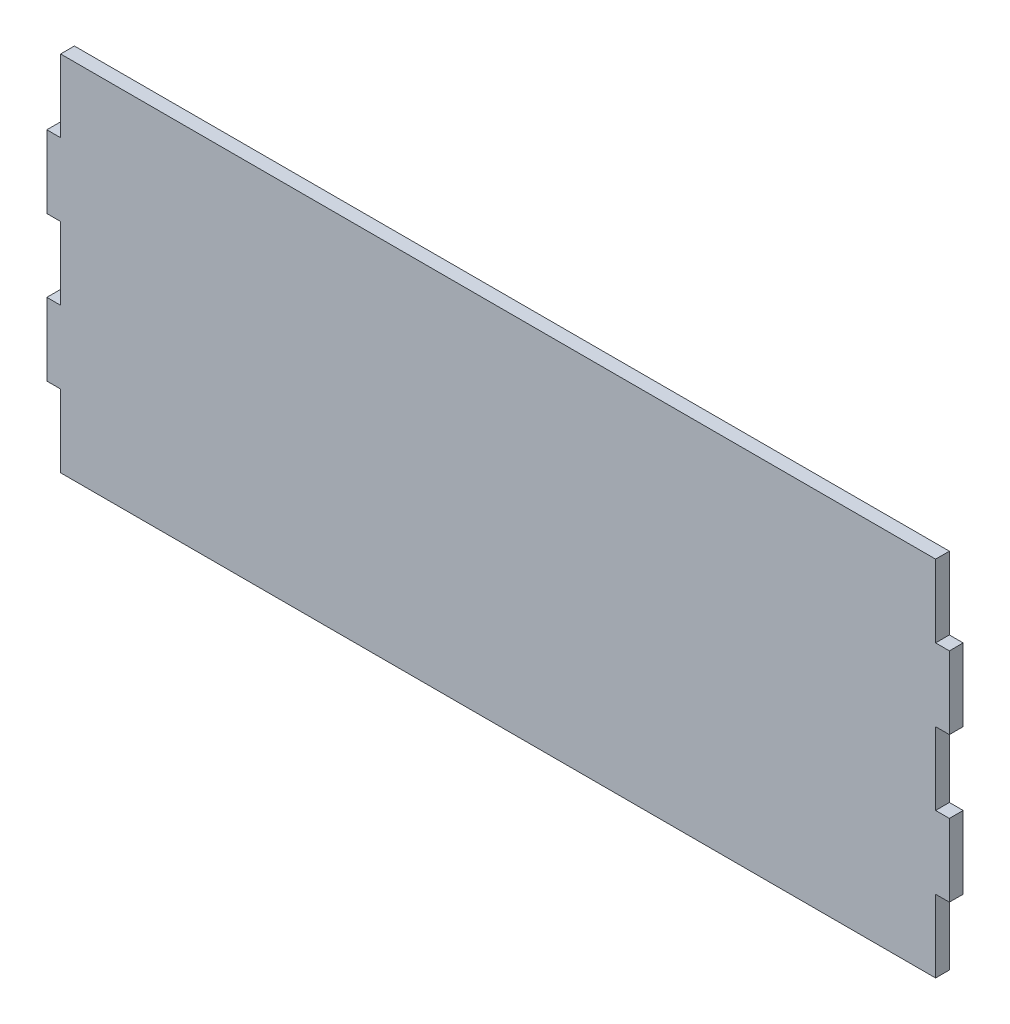
ISO-10303-21;
HEADER;
FILE_DESCRIPTION(('STEP AP214'),'2;1');
FILE_NAME('part.step','',(''),(''),'','','');
FILE_SCHEMA(('AUTOMOTIVE_DESIGN { 1 0 10303 214 1 1 1 1 }'));
ENDSEC;
DATA;
#1=APPLICATION_CONTEXT('core data for automotive mechanical design processes');
#2=APPLICATION_PROTOCOL_DEFINITION('international standard','automotive_design',2000,#1);
#3=PRODUCT_CONTEXT('',#1,'mechanical');
#4=PRODUCT('Part','Part','',(#3));
#5=PRODUCT_RELATED_PRODUCT_CATEGORY('part','',(#4));
#6=PRODUCT_DEFINITION_FORMATION('','',#4);
#7=PRODUCT_DEFINITION_CONTEXT('part definition',#1,'design');
#8=PRODUCT_DEFINITION('design','',#6,#7);
#9=PRODUCT_DEFINITION_SHAPE('','',#8);
#10=(LENGTH_UNIT() NAMED_UNIT(*) SI_UNIT(.MILLI.,.METRE.));
#11=(NAMED_UNIT(*) PLANE_ANGLE_UNIT() SI_UNIT($,.RADIAN.));
#12=(NAMED_UNIT(*) SI_UNIT($,.STERADIAN.) SOLID_ANGLE_UNIT());
#13=UNCERTAINTY_MEASURE_WITH_UNIT(LENGTH_MEASURE(1.E-05),#10,'distance_accuracy_value','');
#14=(GEOMETRIC_REPRESENTATION_CONTEXT(3) GLOBAL_UNCERTAINTY_ASSIGNED_CONTEXT((#13)) GLOBAL_UNIT_ASSIGNED_CONTEXT((#10,
#11,#12)) REPRESENTATION_CONTEXT('',''));
#15=CARTESIAN_POINT('',(0.,0.,0.));
#16=DIRECTION('',(0.,0.,1.));
#17=DIRECTION('',(1.,0.,0.));
#18=AXIS2_PLACEMENT_3D('',#15,#16,#17);
#19=CARTESIAN_POINT('',(4.82599999999997,127.,4.826));
#20=DIRECTION('',(1.,0.,0.));
#21=DIRECTION('',(0.,1.,0.));
#22=AXIS2_PLACEMENT_3D('',#19,#20,#21);
#23=PLANE('',#22);
#24=DIRECTION('',(0.,-1.,0.));
#25=VECTOR('',#24,1.);
#26=CARTESIAN_POINT('',(4.82599999999997,127.,0.));
#27=LINE('',#26,#25);
#28=CARTESIAN_POINT('',(4.82599999999997,127.,0.));
#29=VERTEX_POINT('',#28);
#30=CARTESIAN_POINT('',(4.82599999999999,101.6,0.));
#31=VERTEX_POINT('',#30);
#32=EDGE_CURVE('E203',#29,#31,#27,.T.);
#33=ORIENTED_EDGE('',*,*,#32,.T.);
#34=DIRECTION('',(0.,0.,-1.));
#35=VECTOR('',#34,1.);
#36=CARTESIAN_POINT('',(4.82599999999999,101.6,4.826));
#37=LINE('',#36,#35);
#38=CARTESIAN_POINT('',(4.82599999999999,101.6,4.826));
#39=VERTEX_POINT('',#38);
#40=EDGE_CURVE('E11',#39,#31,#37,.T.);
#41=ORIENTED_EDGE('',*,*,#40,.F.);
#42=DIRECTION('',(0.,-1.,0.));
#43=VECTOR('',#42,1.);
#44=CARTESIAN_POINT('',(4.82599999999997,127.,4.826));
#45=LINE('',#44,#43);
#46=CARTESIAN_POINT('',(4.82599999999997,127.,4.826));
#47=VERTEX_POINT('',#46);
#48=EDGE_CURVE('E125',#47,#39,#45,.T.);
#49=ORIENTED_EDGE('',*,*,#48,.F.);
#50=DIRECTION('',(0.,0.,-1.));
#51=VECTOR('',#50,1.);
#52=CARTESIAN_POINT('',(4.82599999999997,127.,4.826));
#53=LINE('',#52,#51);
#54=EDGE_CURVE('E51',#47,#29,#53,.T.);
#55=ORIENTED_EDGE('',*,*,#54,.T.);
#56=EDGE_LOOP('',(#33,#41,#49,#55));
#57=FACE_BOUND('',#56,.T.);
#58=ADVANCED_FACE('F35',(#57),#23,.F.);
#59=CARTESIAN_POINT('',(0.,101.6,4.826));
#60=DIRECTION('',(0.,1.,0.));
#61=DIRECTION('',(-1.,0.,0.));
#62=AXIS2_PLACEMENT_3D('',#59,#60,#61);
#63=PLANE('',#62);
#64=DIRECTION('',(1.,0.,0.));
#65=VECTOR('',#64,1.);
#66=CARTESIAN_POINT('',(0.,101.6,0.));
#67=LINE('',#66,#65);
#68=CARTESIAN_POINT('',(0.,101.6,0.));
#69=VERTEX_POINT('',#68);
#70=EDGE_CURVE('E205',#69,#31,#67,.T.);
#71=ORIENTED_EDGE('',*,*,#70,.F.);
#72=DIRECTION('',(0.,0.,-1.));
#73=VECTOR('',#72,1.);
#74=CARTESIAN_POINT('',(0.,101.6,4.826));
#75=LINE('',#74,#73);
#76=CARTESIAN_POINT('',(0.,101.6,4.826));
#77=VERTEX_POINT('',#76);
#78=EDGE_CURVE('E43',#77,#69,#75,.T.);
#79=ORIENTED_EDGE('',*,*,#78,.F.);
#80=DIRECTION('',(1.,0.,0.));
#81=VECTOR('',#80,1.);
#82=CARTESIAN_POINT('',(0.,101.6,4.826));
#83=LINE('',#82,#81);
#84=EDGE_CURVE('E366',#77,#39,#83,.T.);
#85=ORIENTED_EDGE('',*,*,#84,.T.);
#86=ORIENTED_EDGE('',*,*,#40,.T.);
#87=EDGE_LOOP('',(#71,#79,#85,#86));
#88=FACE_BOUND('',#87,.T.);
#89=ADVANCED_FACE('F298',(#88),#63,.T.);
#90=CARTESIAN_POINT('',(0.,76.2,4.826));
#91=DIRECTION('',(-1.,0.,0.));
#92=DIRECTION('',(0.,-1.,0.));
#93=AXIS2_PLACEMENT_3D('',#90,#91,#92);
#94=PLANE('',#93);
#95=DIRECTION('',(0.,1.,0.));
#96=VECTOR('',#95,1.);
#97=CARTESIAN_POINT('',(0.,76.2,0.));
#98=LINE('',#97,#96);
#99=CARTESIAN_POINT('',(0.,76.2,0.));
#100=VERTEX_POINT('',#99);
#101=EDGE_CURVE('E208',#100,#69,#98,.T.);
#102=ORIENTED_EDGE('',*,*,#101,.F.);
#103=DIRECTION('',(0.,0.,-1.));
#104=VECTOR('',#103,1.);
#105=CARTESIAN_POINT('',(0.,76.2,4.826));
#106=LINE('',#105,#104);
#107=CARTESIAN_POINT('',(0.,76.2,4.826));
#108=VERTEX_POINT('',#107);
#109=EDGE_CURVE('E288',#108,#100,#106,.T.);
#110=ORIENTED_EDGE('',*,*,#109,.F.);
#111=DIRECTION('',(0.,1.,0.));
#112=VECTOR('',#111,1.);
#113=CARTESIAN_POINT('',(0.,76.2,4.826));
#114=LINE('',#113,#112);
#115=EDGE_CURVE('E295',#108,#77,#114,.T.);
#116=ORIENTED_EDGE('',*,*,#115,.T.);
#117=ORIENTED_EDGE('',*,*,#78,.T.);
#118=EDGE_LOOP('',(#102,#110,#116,#117));
#119=FACE_BOUND('',#118,.T.);
#120=ADVANCED_FACE('F293',(#119),#94,.T.);
#121=CARTESIAN_POINT('',(0.,76.2,4.826));
#122=DIRECTION('',(0.,1.,0.));
#123=DIRECTION('',(-1.,0.,0.));
#124=AXIS2_PLACEMENT_3D('',#121,#122,#123);
#125=PLANE('',#124);
#126=DIRECTION('',(1.,0.,0.));
#127=VECTOR('',#126,1.);
#128=CARTESIAN_POINT('',(0.,76.2,0.));
#129=LINE('',#128,#127);
#130=CARTESIAN_POINT('',(4.82599999999998,76.2,0.));
#131=VERTEX_POINT('',#130);
#132=EDGE_CURVE('E211',#100,#131,#129,.T.);
#133=ORIENTED_EDGE('',*,*,#132,.T.);
#134=DIRECTION('',(0.,0.,-1.));
#135=VECTOR('',#134,1.);
#136=CARTESIAN_POINT('',(4.82599999999998,76.2,4.826));
#137=LINE('',#136,#135);
#138=CARTESIAN_POINT('',(4.82599999999998,76.2,4.826));
#139=VERTEX_POINT('',#138);
#140=EDGE_CURVE('E285',#139,#131,#137,.T.);
#141=ORIENTED_EDGE('',*,*,#140,.F.);
#142=DIRECTION('',(1.,0.,0.));
#143=VECTOR('',#142,1.);
#144=CARTESIAN_POINT('',(0.,76.2,4.826));
#145=LINE('',#144,#143);
#146=EDGE_CURVE('E315',#108,#139,#145,.T.);
#147=ORIENTED_EDGE('',*,*,#146,.F.);
#148=ORIENTED_EDGE('',*,*,#109,.T.);
#149=EDGE_LOOP('',(#133,#141,#147,#148));
#150=FACE_BOUND('',#149,.T.);
#151=ADVANCED_FACE('F305',(#150),#125,.F.);
#152=CARTESIAN_POINT('',(4.82599999999998,76.2,4.826));
#153=DIRECTION('',(1.,0.,0.));
#154=DIRECTION('',(0.,1.,0.));
#155=AXIS2_PLACEMENT_3D('',#152,#153,#154);
#156=PLANE('',#155);
#157=DIRECTION('',(0.,-1.,0.));
#158=VECTOR('',#157,1.);
#159=CARTESIAN_POINT('',(4.82599999999998,76.2,0.));
#160=LINE('',#159,#158);
#161=CARTESIAN_POINT('',(4.82599999999995,50.8,0.));
#162=VERTEX_POINT('',#161);
#163=EDGE_CURVE('E213',#131,#162,#160,.T.);
#164=ORIENTED_EDGE('',*,*,#163,.T.);
#165=DIRECTION('',(0.,0.,-1.));
#166=VECTOR('',#165,1.);
#167=CARTESIAN_POINT('',(4.82599999999995,50.8,4.826));
#168=LINE('',#167,#166);
#169=CARTESIAN_POINT('',(4.82599999999995,50.8,4.826));
#170=VERTEX_POINT('',#169);
#171=EDGE_CURVE('E283',#170,#162,#168,.T.);
#172=ORIENTED_EDGE('',*,*,#171,.F.);
#173=DIRECTION('',(0.,-1.,0.));
#174=VECTOR('',#173,1.);
#175=CARTESIAN_POINT('',(4.82599999999998,76.2,4.826));
#176=LINE('',#175,#174);
#177=EDGE_CURVE('E311',#139,#170,#176,.T.);
#178=ORIENTED_EDGE('',*,*,#177,.F.);
#179=ORIENTED_EDGE('',*,*,#140,.T.);
#180=EDGE_LOOP('',(#164,#172,#178,#179));
#181=FACE_BOUND('',#180,.T.);
#182=ADVANCED_FACE('F309',(#181),#156,.F.);
#183=CARTESIAN_POINT('',(0.,50.8,4.826));
#184=DIRECTION('',(0.,1.,0.));
#185=DIRECTION('',(-1.,0.,0.));
#186=AXIS2_PLACEMENT_3D('',#183,#184,#185);
#187=PLANE('',#186);
#188=DIRECTION('',(1.,0.,0.));
#189=VECTOR('',#188,1.);
#190=CARTESIAN_POINT('',(0.,50.8,0.));
#191=LINE('',#190,#189);
#192=CARTESIAN_POINT('',(0.,50.8,0.));
#193=VERTEX_POINT('',#192);
#194=EDGE_CURVE('E216',#193,#162,#191,.T.);
#195=ORIENTED_EDGE('',*,*,#194,.F.);
#196=DIRECTION('',(0.,0.,-1.));
#197=VECTOR('',#196,1.);
#198=CARTESIAN_POINT('',(0.,50.8,4.826));
#199=LINE('',#198,#197);
#200=CARTESIAN_POINT('',(0.,50.8,4.826));
#201=VERTEX_POINT('',#200);
#202=EDGE_CURVE('E281',#201,#193,#199,.T.);
#203=ORIENTED_EDGE('',*,*,#202,.F.);
#204=DIRECTION('',(1.,0.,0.));
#205=VECTOR('',#204,1.);
#206=CARTESIAN_POINT('',(0.,50.8,4.826));
#207=LINE('',#206,#205);
#208=EDGE_CURVE('E314',#201,#170,#207,.T.);
#209=ORIENTED_EDGE('',*,*,#208,.T.);
#210=ORIENTED_EDGE('',*,*,#171,.T.);
#211=EDGE_LOOP('',(#195,#203,#209,#210));
#212=FACE_BOUND('',#211,.T.);
#213=ADVANCED_FACE('F378',(#212),#187,.T.);
#214=CARTESIAN_POINT('',(0.,25.4,4.826));
#215=DIRECTION('',(-1.,0.,0.));
#216=DIRECTION('',(0.,-1.,0.));
#217=AXIS2_PLACEMENT_3D('',#214,#215,#216);
#218=PLANE('',#217);
#219=DIRECTION('',(0.,1.,0.));
#220=VECTOR('',#219,1.);
#221=CARTESIAN_POINT('',(0.,25.4,0.));
#222=LINE('',#221,#220);
#223=CARTESIAN_POINT('',(0.,25.4,0.));
#224=VERTEX_POINT('',#223);
#225=EDGE_CURVE('E219',#224,#193,#222,.T.);
#226=ORIENTED_EDGE('',*,*,#225,.F.);
#227=DIRECTION('',(0.,0.,-1.));
#228=VECTOR('',#227,1.);
#229=CARTESIAN_POINT('',(0.,25.4,4.826));
#230=LINE('',#229,#228);
#231=CARTESIAN_POINT('',(0.,25.4,4.826));
#232=VERTEX_POINT('',#231);
#233=EDGE_CURVE('E279',#232,#224,#230,.T.);
#234=ORIENTED_EDGE('',*,*,#233,.F.);
#235=DIRECTION('',(0.,1.,0.));
#236=VECTOR('',#235,1.);
#237=CARTESIAN_POINT('',(0.,25.4,4.826));
#238=LINE('',#237,#236);
#239=EDGE_CURVE('E317',#232,#201,#238,.T.);
#240=ORIENTED_EDGE('',*,*,#239,.T.);
#241=ORIENTED_EDGE('',*,*,#202,.T.);
#242=EDGE_LOOP('',(#226,#234,#240,#241));
#243=FACE_BOUND('',#242,.T.);
#244=ADVANCED_FACE('F381',(#243),#218,.T.);
#245=CARTESIAN_POINT('',(0.,25.4,4.826));
#246=DIRECTION('',(0.,1.,0.));
#247=DIRECTION('',(-1.,0.,0.));
#248=AXIS2_PLACEMENT_3D('',#245,#246,#247);
#249=PLANE('',#248);
#250=DIRECTION('',(1.,0.,0.));
#251=VECTOR('',#250,1.);
#252=CARTESIAN_POINT('',(0.,25.4,0.));
#253=LINE('',#252,#251);
#254=CARTESIAN_POINT('',(4.82600000000002,25.4,0.));
#255=VERTEX_POINT('',#254);
#256=EDGE_CURVE('E222',#224,#255,#253,.T.);
#257=ORIENTED_EDGE('',*,*,#256,.T.);
#258=DIRECTION('',(0.,0.,-1.));
#259=VECTOR('',#258,1.);
#260=CARTESIAN_POINT('',(4.82600000000002,25.4,4.826));
#261=LINE('',#260,#259);
#262=CARTESIAN_POINT('',(4.82600000000002,25.4,4.826));
#263=VERTEX_POINT('',#262);
#264=EDGE_CURVE('E276',#263,#255,#261,.T.);
#265=ORIENTED_EDGE('',*,*,#264,.F.);
#266=DIRECTION('',(1.,0.,0.));
#267=VECTOR('',#266,1.);
#268=CARTESIAN_POINT('',(0.,25.4,4.826));
#269=LINE('',#268,#267);
#270=EDGE_CURVE('E324',#232,#263,#269,.T.);
#271=ORIENTED_EDGE('',*,*,#270,.F.);
#272=ORIENTED_EDGE('',*,*,#233,.T.);
#273=EDGE_LOOP('',(#257,#265,#271,#272));
#274=FACE_BOUND('',#273,.T.);
#275=ADVANCED_FACE('F385',(#274),#249,.F.);
#276=CARTESIAN_POINT('',(4.82600000000002,25.4,4.826));
#277=DIRECTION('',(1.,0.,0.));
#278=DIRECTION('',(0.,1.,0.));
#279=AXIS2_PLACEMENT_3D('',#276,#277,#278);
#280=PLANE('',#279);
#281=DIRECTION('',(0.,-1.,0.));
#282=VECTOR('',#281,1.);
#283=CARTESIAN_POINT('',(4.82600000000002,25.4,0.));
#284=LINE('',#283,#282);
#285=CARTESIAN_POINT('',(4.82599999999998,0.,0.));
#286=VERTEX_POINT('',#285);
#287=EDGE_CURVE('E224',#255,#286,#284,.T.);
#288=ORIENTED_EDGE('',*,*,#287,.T.);
#289=DIRECTION('',(0.,0.,-1.));
#290=VECTOR('',#289,1.);
#291=CARTESIAN_POINT('',(4.82599999999998,0.,4.826));
#292=LINE('',#291,#290);
#293=CARTESIAN_POINT('',(4.82599999999998,0.,4.826));
#294=VERTEX_POINT('',#293);
#295=EDGE_CURVE('E273',#294,#286,#292,.T.);
#296=ORIENTED_EDGE('',*,*,#295,.F.);
#297=DIRECTION('',(0.,-1.,0.));
#298=VECTOR('',#297,1.);
#299=CARTESIAN_POINT('',(4.82600000000002,25.4,4.826));
#300=LINE('',#299,#298);
#301=EDGE_CURVE('E326',#263,#294,#300,.T.);
#302=ORIENTED_EDGE('',*,*,#301,.F.);
#303=ORIENTED_EDGE('',*,*,#264,.T.);
#304=EDGE_LOOP('',(#288,#296,#302,#303));
#305=FACE_BOUND('',#304,.T.);
#306=ADVANCED_FACE('F389',(#305),#280,.F.);
#307=CARTESIAN_POINT('',(4.82599999999998,0.,4.826));
#308=DIRECTION('',(0.,1.,0.));
#309=DIRECTION('',(-1.,0.,0.));
#310=AXIS2_PLACEMENT_3D('',#307,#308,#309);
#311=PLANE('',#310);
#312=DIRECTION('',(1.,0.,0.));
#313=VECTOR('',#312,1.);
#314=CARTESIAN_POINT('',(4.82599999999998,0.,0.));
#315=LINE('',#314,#313);
#316=CARTESIAN_POINT('',(311.15,0.,0.));
#317=VERTEX_POINT('',#316);
#318=EDGE_CURVE('E226',#286,#317,#315,.T.);
#319=ORIENTED_EDGE('',*,*,#318,.T.);
#320=DIRECTION('',(0.,0.,-1.));
#321=VECTOR('',#320,1.);
#322=CARTESIAN_POINT('',(311.15,0.,4.826));
#323=LINE('',#322,#321);
#324=CARTESIAN_POINT('',(311.15,0.,4.826));
#325=VERTEX_POINT('',#324);
#326=EDGE_CURVE('E270',#325,#317,#323,.T.);
#327=ORIENTED_EDGE('',*,*,#326,.F.);
#328=DIRECTION('',(1.,0.,0.));
#329=VECTOR('',#328,1.);
#330=CARTESIAN_POINT('',(4.82599999999998,0.,4.826));
#331=LINE('',#330,#329);
#332=EDGE_CURVE('E328',#294,#325,#331,.T.);
#333=ORIENTED_EDGE('',*,*,#332,.F.);
#334=ORIENTED_EDGE('',*,*,#295,.T.);
#335=EDGE_LOOP('',(#319,#327,#333,#334));
#336=FACE_BOUND('',#335,.T.);
#337=ADVANCED_FACE('F393',(#336),#311,.F.);
#338=CARTESIAN_POINT('',(311.15,0.,4.826));
#339=DIRECTION('',(-1.,0.,0.));
#340=DIRECTION('',(0.,0.,1.));
#341=AXIS2_PLACEMENT_3D('',#338,#339,#340);
#342=PLANE('',#341);
#343=DIRECTION('',(0.,1.,0.));
#344=VECTOR('',#343,1.);
#345=CARTESIAN_POINT('',(311.15,0.,0.));
#346=LINE('',#345,#344);
#347=CARTESIAN_POINT('',(311.15,25.4,0.));
#348=VERTEX_POINT('',#347);
#349=EDGE_CURVE('E228',#317,#348,#346,.T.);
#350=ORIENTED_EDGE('',*,*,#349,.T.);
#351=DIRECTION('',(0.,0.,-1.));
#352=VECTOR('',#351,1.);
#353=CARTESIAN_POINT('',(311.15,25.4,4.826));
#354=LINE('',#353,#352);
#355=CARTESIAN_POINT('',(311.15,25.4,4.826));
#356=VERTEX_POINT('',#355);
#357=EDGE_CURVE('E267',#356,#348,#354,.T.);
#358=ORIENTED_EDGE('',*,*,#357,.F.);
#359=DIRECTION('',(0.,1.,0.));
#360=VECTOR('',#359,1.);
#361=CARTESIAN_POINT('',(311.15,0.,4.826));
#362=LINE('',#361,#360);
#363=EDGE_CURVE('E330',#325,#356,#362,.T.);
#364=ORIENTED_EDGE('',*,*,#363,.F.);
#365=ORIENTED_EDGE('',*,*,#326,.T.);
#366=EDGE_LOOP('',(#350,#358,#364,#365));
#367=FACE_BOUND('',#366,.T.);
#368=ADVANCED_FACE('F397',(#367),#342,.F.);
#369=CARTESIAN_POINT('',(311.15,25.4,4.826));
#370=DIRECTION('',(0.,1.,0.));
#371=DIRECTION('',(-1.,0.,0.));
#372=AXIS2_PLACEMENT_3D('',#369,#370,#371);
#373=PLANE('',#372);
#374=DIRECTION('',(1.,0.,0.));
#375=VECTOR('',#374,1.);
#376=CARTESIAN_POINT('',(311.15,25.4,0.));
#377=LINE('',#376,#375);
#378=CARTESIAN_POINT('',(315.976,25.3999999999999,0.));
#379=VERTEX_POINT('',#378);
#380=EDGE_CURVE('E230',#348,#379,#377,.T.);
#381=ORIENTED_EDGE('',*,*,#380,.T.);
#382=DIRECTION('',(0.,0.,-1.));
#383=VECTOR('',#382,1.);
#384=CARTESIAN_POINT('',(315.976,25.3999999999999,4.826));
#385=LINE('',#384,#383);
#386=CARTESIAN_POINT('',(315.976,25.3999999999999,4.826));
#387=VERTEX_POINT('',#386);
#388=EDGE_CURVE('E265',#387,#379,#385,.T.);
#389=ORIENTED_EDGE('',*,*,#388,.F.);
#390=DIRECTION('',(1.,0.,0.));
#391=VECTOR('',#390,1.);
#392=CARTESIAN_POINT('',(311.15,25.4,4.826));
#393=LINE('',#392,#391);
#394=EDGE_CURVE('E332',#356,#387,#393,.T.);
#395=ORIENTED_EDGE('',*,*,#394,.F.);
#396=ORIENTED_EDGE('',*,*,#357,.T.);
#397=EDGE_LOOP('',(#381,#389,#395,#396));
#398=FACE_BOUND('',#397,.T.);
#399=ADVANCED_FACE('F401',(#398),#373,.F.);
#400=CARTESIAN_POINT('',(315.976,50.7999999999999,4.826));
#401=DIRECTION('',(1.,0.,0.));
#402=DIRECTION('',(0.,0.,-1.));
#403=AXIS2_PLACEMENT_3D('',#400,#401,#402);
#404=PLANE('',#403);
#405=DIRECTION('',(0.,-1.,0.));
#406=VECTOR('',#405,1.);
#407=CARTESIAN_POINT('',(315.976,50.7999999999999,0.));
#408=LINE('',#407,#406);
#409=CARTESIAN_POINT('',(315.976,50.7999999999999,0.));
#410=VERTEX_POINT('',#409);
#411=EDGE_CURVE('E233',#410,#379,#408,.T.);
#412=ORIENTED_EDGE('',*,*,#411,.F.);
#413=DIRECTION('',(0.,0.,-1.));
#414=VECTOR('',#413,1.);
#415=CARTESIAN_POINT('',(315.976,50.7999999999999,4.826));
#416=LINE('',#415,#414);
#417=CARTESIAN_POINT('',(315.976,50.7999999999999,4.826));
#418=VERTEX_POINT('',#417);
#419=EDGE_CURVE('E263',#418,#410,#416,.T.);
#420=ORIENTED_EDGE('',*,*,#419,.F.);
#421=DIRECTION('',(0.,-1.,0.));
#422=VECTOR('',#421,1.);
#423=CARTESIAN_POINT('',(315.976,50.7999999999999,4.826));
#424=LINE('',#423,#422);
#425=EDGE_CURVE('E334',#418,#387,#424,.T.);
#426=ORIENTED_EDGE('',*,*,#425,.T.);
#427=ORIENTED_EDGE('',*,*,#388,.T.);
#428=EDGE_LOOP('',(#412,#420,#426,#427));
#429=FACE_BOUND('',#428,.T.);
#430=ADVANCED_FACE('F405',(#429),#404,.T.);
#431=CARTESIAN_POINT('',(311.15,50.8,4.826));
#432=DIRECTION('',(0.,1.,0.));
#433=DIRECTION('',(-1.,0.,0.));
#434=AXIS2_PLACEMENT_3D('',#431,#432,#433);
#435=PLANE('',#434);
#436=DIRECTION('',(1.,0.,0.));
#437=VECTOR('',#436,1.);
#438=CARTESIAN_POINT('',(311.15,50.8,0.));
#439=LINE('',#438,#437);
#440=CARTESIAN_POINT('',(311.15,50.8,0.));
#441=VERTEX_POINT('',#440);
#442=EDGE_CURVE('E236',#441,#410,#439,.T.);
#443=ORIENTED_EDGE('',*,*,#442,.F.);
#444=DIRECTION('',(0.,0.,-1.));
#445=VECTOR('',#444,1.);
#446=CARTESIAN_POINT('',(311.15,50.8,4.826));
#447=LINE('',#446,#445);
#448=CARTESIAN_POINT('',(311.15,50.8,4.826));
#449=VERTEX_POINT('',#448);
#450=EDGE_CURVE('E261',#449,#441,#447,.T.);
#451=ORIENTED_EDGE('',*,*,#450,.F.);
#452=DIRECTION('',(1.,0.,0.));
#453=VECTOR('',#452,1.);
#454=CARTESIAN_POINT('',(311.15,50.8,4.826));
#455=LINE('',#454,#453);
#456=EDGE_CURVE('E337',#449,#418,#455,.T.);
#457=ORIENTED_EDGE('',*,*,#456,.T.);
#458=ORIENTED_EDGE('',*,*,#419,.T.);
#459=EDGE_LOOP('',(#443,#451,#457,#458));
#460=FACE_BOUND('',#459,.T.);
#461=ADVANCED_FACE('F409',(#460),#435,.T.);
#462=CARTESIAN_POINT('',(311.15,50.8,4.826));
#463=DIRECTION('',(-1.,0.,0.));
#464=DIRECTION('',(0.,0.,1.));
#465=AXIS2_PLACEMENT_3D('',#462,#463,#464);
#466=PLANE('',#465);
#467=DIRECTION('',(0.,1.,0.));
#468=VECTOR('',#467,1.);
#469=CARTESIAN_POINT('',(311.15,50.8,0.));
#470=LINE('',#469,#468);
#471=CARTESIAN_POINT('',(311.15,76.2,0.));
#472=VERTEX_POINT('',#471);
#473=EDGE_CURVE('E239',#441,#472,#470,.T.);
#474=ORIENTED_EDGE('',*,*,#473,.T.);
#475=DIRECTION('',(0.,0.,-1.));
#476=VECTOR('',#475,1.);
#477=CARTESIAN_POINT('',(311.15,76.2,4.826));
#478=LINE('',#477,#476);
#479=CARTESIAN_POINT('',(311.15,76.2,4.826));
#480=VERTEX_POINT('',#479);
#481=EDGE_CURVE('E258',#480,#472,#478,.T.);
#482=ORIENTED_EDGE('',*,*,#481,.F.);
#483=DIRECTION('',(0.,1.,0.));
#484=VECTOR('',#483,1.);
#485=CARTESIAN_POINT('',(311.15,50.8,4.826));
#486=LINE('',#485,#484);
#487=EDGE_CURVE('E340',#449,#480,#486,.T.);
#488=ORIENTED_EDGE('',*,*,#487,.F.);
#489=ORIENTED_EDGE('',*,*,#450,.T.);
#490=EDGE_LOOP('',(#474,#482,#488,#489));
#491=FACE_BOUND('',#490,.T.);
#492=ADVANCED_FACE('F413',(#491),#466,.F.);
#493=CARTESIAN_POINT('',(311.15,76.2,4.826));
#494=DIRECTION('',(0.,1.,0.));
#495=DIRECTION('',(-1.,0.,0.));
#496=AXIS2_PLACEMENT_3D('',#493,#494,#495);
#497=PLANE('',#496);
#498=DIRECTION('',(1.,0.,0.));
#499=VECTOR('',#498,1.);
#500=CARTESIAN_POINT('',(311.15,76.2,0.));
#501=LINE('',#500,#499);
#502=CARTESIAN_POINT('',(315.976,76.1999999999999,0.));
#503=VERTEX_POINT('',#502);
#504=EDGE_CURVE('E241',#472,#503,#501,.T.);
#505=ORIENTED_EDGE('',*,*,#504,.T.);
#506=DIRECTION('',(0.,0.,-1.));
#507=VECTOR('',#506,1.);
#508=CARTESIAN_POINT('',(315.976,76.1999999999999,4.826));
#509=LINE('',#508,#507);
#510=CARTESIAN_POINT('',(315.976,76.1999999999999,4.826));
#511=VERTEX_POINT('',#510);
#512=EDGE_CURVE('E256',#511,#503,#509,.T.);
#513=ORIENTED_EDGE('',*,*,#512,.F.);
#514=DIRECTION('',(1.,0.,0.));
#515=VECTOR('',#514,1.);
#516=CARTESIAN_POINT('',(311.15,76.2,4.826));
#517=LINE('',#516,#515);
#518=EDGE_CURVE('E198',#480,#511,#517,.T.);
#519=ORIENTED_EDGE('',*,*,#518,.F.);
#520=ORIENTED_EDGE('',*,*,#481,.T.);
#521=EDGE_LOOP('',(#505,#513,#519,#520));
#522=FACE_BOUND('',#521,.T.);
#523=ADVANCED_FACE('F347',(#522),#497,.F.);
#524=CARTESIAN_POINT('',(315.976,101.6,4.826));
#525=DIRECTION('',(1.,0.,0.));
#526=DIRECTION('',(0.,0.,-1.));
#527=AXIS2_PLACEMENT_3D('',#524,#525,#526);
#528=PLANE('',#527);
#529=DIRECTION('',(0.,-1.,0.));
#530=VECTOR('',#529,1.);
#531=CARTESIAN_POINT('',(315.976,101.6,0.));
#532=LINE('',#531,#530);
#533=CARTESIAN_POINT('',(315.976,101.6,0.));
#534=VERTEX_POINT('',#533);
#535=EDGE_CURVE('E244',#534,#503,#532,.T.);
#536=ORIENTED_EDGE('',*,*,#535,.F.);
#537=DIRECTION('',(0.,0.,-1.));
#538=VECTOR('',#537,1.);
#539=CARTESIAN_POINT('',(315.976,101.6,4.826));
#540=LINE('',#539,#538);
#541=CARTESIAN_POINT('',(315.976,101.6,4.826));
#542=VERTEX_POINT('',#541);
#543=EDGE_CURVE('E187',#542,#534,#540,.T.);
#544=ORIENTED_EDGE('',*,*,#543,.F.);
#545=DIRECTION('',(0.,-1.,0.));
#546=VECTOR('',#545,1.);
#547=CARTESIAN_POINT('',(315.976,101.6,4.826));
#548=LINE('',#547,#546);
#549=EDGE_CURVE('E196',#542,#511,#548,.T.);
#550=ORIENTED_EDGE('',*,*,#549,.T.);
#551=ORIENTED_EDGE('',*,*,#512,.T.);
#552=EDGE_LOOP('',(#536,#544,#550,#551));
#553=FACE_BOUND('',#552,.T.);
#554=ADVANCED_FACE('F351',(#553),#528,.T.);
#555=CARTESIAN_POINT('',(311.15,101.6,4.826));
#556=DIRECTION('',(0.,1.,0.));
#557=DIRECTION('',(-1.,0.,0.));
#558=AXIS2_PLACEMENT_3D('',#555,#556,#557);
#559=PLANE('',#558);
#560=DIRECTION('',(1.,0.,0.));
#561=VECTOR('',#560,1.);
#562=CARTESIAN_POINT('',(311.15,101.6,0.));
#563=LINE('',#562,#561);
#564=CARTESIAN_POINT('',(311.15,101.6,0.));
#565=VERTEX_POINT('',#564);
#566=EDGE_CURVE('E184',#565,#534,#563,.T.);
#567=ORIENTED_EDGE('',*,*,#566,.F.);
#568=DIRECTION('',(0.,0.,-1.));
#569=VECTOR('',#568,1.);
#570=CARTESIAN_POINT('',(311.15,101.6,4.826));
#571=LINE('',#570,#569);
#572=CARTESIAN_POINT('',(311.15,101.6,4.826));
#573=VERTEX_POINT('',#572);
#574=EDGE_CURVE('E178',#573,#565,#571,.T.);
#575=ORIENTED_EDGE('',*,*,#574,.F.);
#576=DIRECTION('',(1.,0.,0.));
#577=VECTOR('',#576,1.);
#578=CARTESIAN_POINT('',(311.15,101.6,4.826));
#579=LINE('',#578,#577);
#580=EDGE_CURVE('E182',#573,#542,#579,.T.);
#581=ORIENTED_EDGE('',*,*,#580,.T.);
#582=ORIENTED_EDGE('',*,*,#543,.T.);
#583=EDGE_LOOP('',(#567,#575,#581,#582));
#584=FACE_BOUND('',#583,.T.);
#585=ADVANCED_FACE('F180',(#584),#559,.T.);
#586=CARTESIAN_POINT('',(311.15,101.6,4.826));
#587=DIRECTION('',(-1.,0.,0.));
#588=DIRECTION('',(0.,0.,1.));
#589=AXIS2_PLACEMENT_3D('',#586,#587,#588);
#590=PLANE('',#589);
#591=DIRECTION('',(0.,1.,0.));
#592=VECTOR('',#591,1.);
#593=CARTESIAN_POINT('',(311.15,101.6,0.));
#594=LINE('',#593,#592);
#595=CARTESIAN_POINT('',(311.15,127.,0.));
#596=VERTEX_POINT('',#595);
#597=EDGE_CURVE('E248',#565,#596,#594,.T.);
#598=ORIENTED_EDGE('',*,*,#597,.T.);
#599=DIRECTION('',(0.,0.,-1.));
#600=VECTOR('',#599,1.);
#601=CARTESIAN_POINT('',(311.15,127.,4.826));
#602=LINE('',#601,#600);
#603=CARTESIAN_POINT('',(311.15,127.,4.826));
#604=VERTEX_POINT('',#603);
#605=EDGE_CURVE('E113',#604,#596,#602,.T.);
#606=ORIENTED_EDGE('',*,*,#605,.F.);
#607=DIRECTION('',(0.,1.,0.));
#608=VECTOR('',#607,1.);
#609=CARTESIAN_POINT('',(311.15,101.6,4.826));
#610=LINE('',#609,#608);
#611=EDGE_CURVE('E189',#573,#604,#610,.T.);
#612=ORIENTED_EDGE('',*,*,#611,.F.);
#613=ORIENTED_EDGE('',*,*,#574,.T.);
#614=EDGE_LOOP('',(#598,#606,#612,#613));
#615=FACE_BOUND('',#614,.T.);
#616=ADVANCED_FACE('F190',(#615),#590,.F.);
#617=CARTESIAN_POINT('',(4.82599999999997,127.,4.826));
#618=DIRECTION('',(0.,1.,0.));
#619=DIRECTION('',(0.,0.,1.));
#620=AXIS2_PLACEMENT_3D('',#617,#618,#619);
#621=PLANE('',#620);
#622=DIRECTION('',(1.,0.,0.));
#623=VECTOR('',#622,1.);
#624=CARTESIAN_POINT('',(4.82599999999997,127.,0.));
#625=LINE('',#624,#623);
#626=EDGE_CURVE('E250',#29,#596,#625,.T.);
#627=ORIENTED_EDGE('',*,*,#626,.F.);
#628=ORIENTED_EDGE('',*,*,#54,.F.);
#629=DIRECTION('',(1.,0.,0.));
#630=VECTOR('',#629,1.);
#631=CARTESIAN_POINT('',(4.82599999999997,127.,4.826));
#632=LINE('',#631,#630);
#633=EDGE_CURVE('E191',#47,#604,#632,.T.);
#634=ORIENTED_EDGE('',*,*,#633,.T.);
#635=ORIENTED_EDGE('',*,*,#605,.T.);
#636=EDGE_LOOP('',(#627,#628,#634,#635));
#637=FACE_BOUND('',#636,.T.);
#638=ADVANCED_FACE('F352',(#637),#621,.T.);
#639=CARTESIAN_POINT('',(0.,0.,4.826));
#640=DIRECTION('',(0.,0.,1.));
#641=DIRECTION('',(1.,0.,0.));
#642=AXIS2_PLACEMENT_3D('',#639,#640,#641);
#643=PLANE('',#642);
#644=ORIENTED_EDGE('',*,*,#48,.T.);
#645=ORIENTED_EDGE('',*,*,#84,.F.);
#646=ORIENTED_EDGE('',*,*,#115,.F.);
#647=ORIENTED_EDGE('',*,*,#146,.T.);
#648=ORIENTED_EDGE('',*,*,#177,.T.);
#649=ORIENTED_EDGE('',*,*,#208,.F.);
#650=ORIENTED_EDGE('',*,*,#239,.F.);
#651=ORIENTED_EDGE('',*,*,#270,.T.);
#652=ORIENTED_EDGE('',*,*,#301,.T.);
#653=ORIENTED_EDGE('',*,*,#332,.T.);
#654=ORIENTED_EDGE('',*,*,#363,.T.);
#655=ORIENTED_EDGE('',*,*,#394,.T.);
#656=ORIENTED_EDGE('',*,*,#425,.F.);
#657=ORIENTED_EDGE('',*,*,#456,.F.);
#658=ORIENTED_EDGE('',*,*,#487,.T.);
#659=ORIENTED_EDGE('',*,*,#518,.T.);
#660=ORIENTED_EDGE('',*,*,#549,.F.);
#661=ORIENTED_EDGE('',*,*,#580,.F.);
#662=ORIENTED_EDGE('',*,*,#611,.T.);
#663=ORIENTED_EDGE('',*,*,#633,.F.);
#664=EDGE_LOOP('',(#644,#645,#646,#647,#648,#649,#650,#651,#652,#653,#654,#655,#656,#657,#658,
#659,#660,#661,#662,#663));
#665=FACE_BOUND('',#664,.T.);
#666=ADVANCED_FACE('F194',(#665),#643,.T.);
#667=CARTESIAN_POINT('',(0.,0.,0.));
#668=DIRECTION('',(0.,0.,1.));
#669=DIRECTION('',(1.,0.,0.));
#670=AXIS2_PLACEMENT_3D('',#667,#668,#669);
#671=PLANE('',#670);
#672=ORIENTED_EDGE('',*,*,#32,.F.);
#673=ORIENTED_EDGE('',*,*,#626,.T.);
#674=ORIENTED_EDGE('',*,*,#597,.F.);
#675=ORIENTED_EDGE('',*,*,#566,.T.);
#676=ORIENTED_EDGE('',*,*,#535,.T.);
#677=ORIENTED_EDGE('',*,*,#504,.F.);
#678=ORIENTED_EDGE('',*,*,#473,.F.);
#679=ORIENTED_EDGE('',*,*,#442,.T.);
#680=ORIENTED_EDGE('',*,*,#411,.T.);
#681=ORIENTED_EDGE('',*,*,#380,.F.);
#682=ORIENTED_EDGE('',*,*,#349,.F.);
#683=ORIENTED_EDGE('',*,*,#318,.F.);
#684=ORIENTED_EDGE('',*,*,#287,.F.);
#685=ORIENTED_EDGE('',*,*,#256,.F.);
#686=ORIENTED_EDGE('',*,*,#225,.T.);
#687=ORIENTED_EDGE('',*,*,#194,.T.);
#688=ORIENTED_EDGE('',*,*,#163,.F.);
#689=ORIENTED_EDGE('',*,*,#132,.F.);
#690=ORIENTED_EDGE('',*,*,#101,.T.);
#691=ORIENTED_EDGE('',*,*,#70,.T.);
#692=EDGE_LOOP('',(#672,#673,#674,#675,#676,#677,#678,#679,#680,#681,#682,#683,#684,#685,#686,
#687,#688,#689,#690,#691));
#693=FACE_BOUND('',#692,.T.);
#694=ADVANCED_FACE('F301',(#693),#671,.F.);
#695=CLOSED_SHELL('',(#58,#89,#120,#151,#182,#213,#244,#275,#306,#337,#368,#399,#430,#461,#492,
#523,#554,#585,#616,#638,#666,#694));
#696=MANIFOLD_SOLID_BREP('B2',#695);
#697=ADVANCED_BREP_SHAPE_REPRESENTATION('',(#18,#696),#14);
#698=SHAPE_DEFINITION_REPRESENTATION(#9,#697);
ENDSEC;
END-ISO-10303-21;
